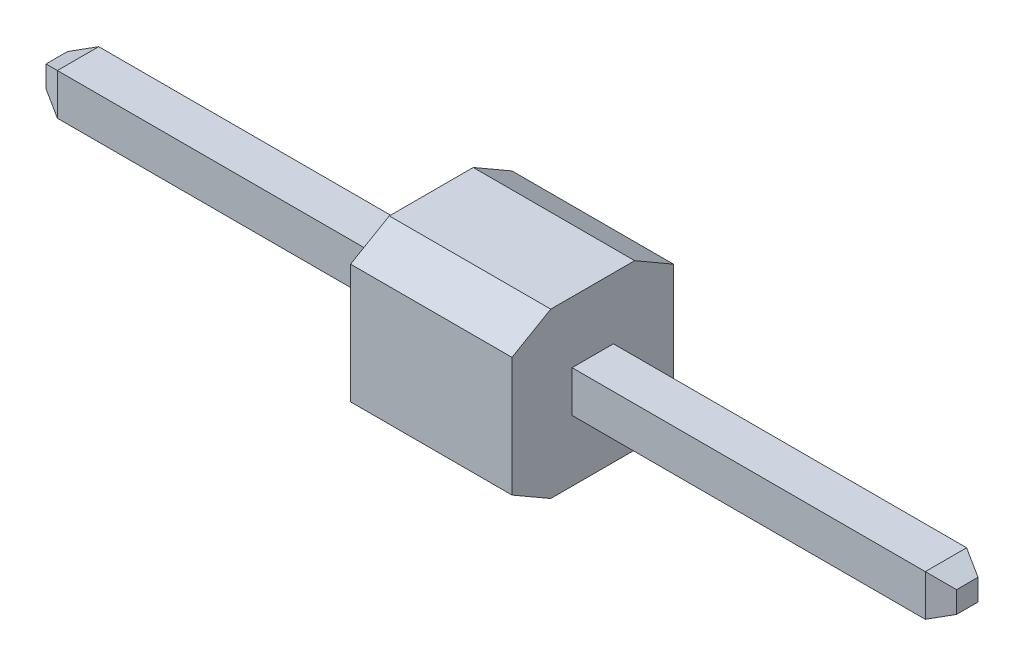
ISO-10303-21;
HEADER;
FILE_DESCRIPTION(('STEP AP214'),'2;1');
FILE_NAME('part.step','',(''),(''),'','','');
FILE_SCHEMA(('AUTOMOTIVE_DESIGN { 1 0 10303 214 1 1 1 1 }'));
ENDSEC;
DATA;
#1=APPLICATION_CONTEXT('core data for automotive mechanical design processes');
#2=APPLICATION_PROTOCOL_DEFINITION('international standard','automotive_design',2000,#1);
#3=PRODUCT_CONTEXT('',#1,'mechanical');
#4=PRODUCT('Part','Part','',(#3));
#5=PRODUCT_RELATED_PRODUCT_CATEGORY('part','',(#4));
#6=PRODUCT_DEFINITION_FORMATION('','',#4);
#7=PRODUCT_DEFINITION_CONTEXT('part definition',#1,'design');
#8=PRODUCT_DEFINITION('design','',#6,#7);
#9=PRODUCT_DEFINITION_SHAPE('','',#8);
#10=(LENGTH_UNIT() NAMED_UNIT(*) SI_UNIT(.MILLI.,.METRE.));
#11=(NAMED_UNIT(*) PLANE_ANGLE_UNIT() SI_UNIT($,.RADIAN.));
#12=(NAMED_UNIT(*) SI_UNIT($,.STERADIAN.) SOLID_ANGLE_UNIT());
#13=UNCERTAINTY_MEASURE_WITH_UNIT(LENGTH_MEASURE(1.E-05),#10,'distance_accuracy_value','');
#14=(GEOMETRIC_REPRESENTATION_CONTEXT(3) GLOBAL_UNCERTAINTY_ASSIGNED_CONTEXT((#13)) GLOBAL_UNIT_ASSIGNED_CONTEXT((#10,
#11,#12)) REPRESENTATION_CONTEXT('',''));
#15=CARTESIAN_POINT('',(0.,0.,0.));
#16=DIRECTION('',(0.,0.,1.));
#17=DIRECTION('',(1.,0.,0.));
#18=AXIS2_PLACEMENT_3D('',#15,#16,#17);
#19=CARTESIAN_POINT('',(5.4210498472222,-9.84287855189696,-2.62999736619335));
#20=DIRECTION('',(1.,-9.93476518829084E-08,4.37113882867379E-08));
#21=DIRECTION('',(-9.93476589883358E-08,-1.,8.74227765734759E-08));
#22=AXIS2_PLACEMENT_3D('',#19,#20,#21);
#23=PLANE('',#22);
#24=DIRECTION('',(-1.18186632778994E-08,-0.500000075710538,-0.866025360072935));
#25=VECTOR('',#24,1.);
#26=CARTESIAN_POINT('',(5.4210496550476,-11.0864682531292,-1.05999725747527));
#27=LINE('',#26,#25);
#28=CARTESIAN_POINT('',(5.4210496550476,-11.0864682531292,-1.05999725747527));
#29=VERTEX_POINT('',#28);
#30=CARTESIAN_POINT('',(5.42104964685939,-11.4328784670969,-1.65999722719114));
#31=VERTEX_POINT('',#30);
#32=EDGE_CURVE('E11',#29,#31,#27,.T.);
#33=ORIENTED_EDGE('',*,*,#32,.T.);
#34=DIRECTION('',(4.37113811813104E-08,-8.74227842254741E-08,-0.999999999999995));
#35=VECTOR('',#34,1.);
#36=CARTESIAN_POINT('',(5.42104964685939,-11.4328784670969,-1.65999722719114));
#37=LINE('',#36,#35);
#38=CARTESIAN_POINT('',(5.42104970368418,-11.4328785807465,-2.95999722719114));
#39=VERTEX_POINT('',#38);
#40=EDGE_CURVE('E304',#31,#39,#37,.T.);
#41=ORIENTED_EDGE('',*,*,#40,.T.);
#42=DIRECTION('',(8.75289963529268E-08,0.499999924289837,-0.866025447495713));
#43=VECTOR('',#42,1.);
#44=CARTESIAN_POINT('',(5.42104970368418,-11.4328785807465,-2.95999722719114));
#45=LINE('',#44,#43);
#46=CARTESIAN_POINT('',(5.42104976432605,-11.0864684716862,-3.55999725747527));
#47=VERTEX_POINT('',#46);
#48=EDGE_CURVE('E296',#39,#47,#45,.T.);
#49=ORIENTED_EDGE('',*,*,#48,.T.);
#50=DIRECTION('',(9.93476593243698E-08,0.999999999999991,-8.74227764821842E-08));
#51=VECTOR('',#50,1.);
#52=CARTESIAN_POINT('',(5.42104976432605,-11.0864684716862,-3.55999725747527));
#53=LINE('',#52,#51);
#54=CARTESIAN_POINT('',(5.42104994783903,-9.23928879471415,-3.55999741896085));
#55=VERTEX_POINT('',#54);
#56=EDGE_CURVE('E281',#47,#55,#53,.T.);
#57=ORIENTED_EDGE('',*,*,#56,.T.);
#58=DIRECTION('',(-1.18186619959243E-08,-0.500000075710538,-0.866025360072935));
#59=VECTOR('',#58,1.);
#60=CARTESIAN_POINT('',(5.42104995602724,-8.89287858074648,-2.95999744924499));
#61=LINE('',#60,#59);
#62=CARTESIAN_POINT('',(5.42104995602724,-8.89287858074648,-2.95999744924499));
#63=VERTEX_POINT('',#62);
#64=EDGE_CURVE('E265',#63,#55,#61,.T.);
#65=ORIENTED_EDGE('',*,*,#64,.F.);
#66=DIRECTION('',(4.37113811813104E-08,-8.74227842254741E-08,-0.999999999999995));
#67=VECTOR('',#66,1.);
#68=CARTESIAN_POINT('',(5.42104989920244,-8.89287846709686,-1.65999744924499));
#69=LINE('',#68,#67);
#70=CARTESIAN_POINT('',(5.42104989920244,-8.89287846709686,-1.65999744924499));
#71=VERTEX_POINT('',#70);
#72=EDGE_CURVE('E248',#71,#63,#69,.T.);
#73=ORIENTED_EDGE('',*,*,#72,.F.);
#74=DIRECTION('',(8.75289950709517E-08,0.499999924289837,-0.866025447495713));
#75=VECTOR('',#74,1.);
#76=CARTESIAN_POINT('',(5.42104983856057,-9.23928857615719,-1.05999741896085));
#77=LINE('',#76,#75);
#78=CARTESIAN_POINT('',(5.42104983856057,-9.23928857615719,-1.05999741896085));
#79=VERTEX_POINT('',#78);
#80=EDGE_CURVE('E242',#79,#71,#77,.T.);
#81=ORIENTED_EDGE('',*,*,#80,.F.);
#82=DIRECTION('',(9.93476593243698E-08,0.999999999999991,-8.74227764821842E-08));
#83=VECTOR('',#82,1.);
#84=CARTESIAN_POINT('',(5.4210496550476,-11.0864682531292,-1.05999725747527));
#85=LINE('',#84,#83);
#86=EDGE_CURVE('E236',#29,#79,#85,.T.);
#87=ORIENTED_EDGE('',*,*,#86,.F.);
#88=EDGE_LOOP('',(#33,#41,#49,#57,#65,#73,#81,#87));
#89=FACE_BOUND('',#88,.T.);
#90=DIRECTION('',(-4.37113817364219E-08,8.74227829017466E-08,0.999999999999995));
#91=VECTOR('',#90,1.);
#92=CARTESIAN_POINT('',(5.4210497836397,-10.482878551897,-2.62999731024277));
#93=LINE('',#92,#91);
#94=CARTESIAN_POINT('',(5.4210497836397,-10.482878551897,-2.62999731024277));
#95=VERTEX_POINT('',#94);
#96=CARTESIAN_POINT('',(5.42104975566442,-10.4828784959464,-1.98999731024277));
#97=VERTEX_POINT('',#96);
#98=EDGE_CURVE('E302',#95,#97,#93,.T.);
#99=ORIENTED_EDGE('',*,*,#98,.T.);
#100=DIRECTION('',(-9.93476592658906E-08,-0.999999999999991,8.74227766567418E-08));
#101=VECTOR('',#100,1.);
#102=CARTESIAN_POINT('',(5.42104981924692,-9.84287849594638,-1.98999736619335));
#103=LINE('',#102,#101);
#104=CARTESIAN_POINT('',(5.42104981924692,-9.84287849594638,-1.98999736619335));
#105=VERTEX_POINT('',#104);
#106=EDGE_CURVE('E293',#105,#97,#103,.T.);
#107=ORIENTED_EDGE('',*,*,#106,.F.);
#108=DIRECTION('',(-4.37113817364219E-08,8.74227856773042E-08,0.999999999999995));
#109=VECTOR('',#108,1.);
#110=CARTESIAN_POINT('',(5.4210498472222,-9.84287855189696,-2.62999736619335));
#111=LINE('',#110,#109);
#112=CARTESIAN_POINT('',(5.4210498472222,-9.84287855189696,-2.62999736619335));
#113=VERTEX_POINT('',#112);
#114=EDGE_CURVE('E278',#113,#105,#111,.T.);
#115=ORIENTED_EDGE('',*,*,#114,.F.);
#116=DIRECTION('',(-9.93476592658908E-08,-0.999999999999991,8.7422776656742E-08));
#117=VECTOR('',#116,1.);
#118=CARTESIAN_POINT('',(5.4210498472222,-9.84287855189696,-2.62999736619335));
#119=LINE('',#118,#117);
#120=EDGE_CURVE('E263',#113,#95,#119,.T.);
#121=ORIENTED_EDGE('',*,*,#120,.T.);
#122=EDGE_LOOP('',(#99,#107,#115,#121));
#123=FACE_BOUND('',#122,.T.);
#124=ADVANCED_FACE('F17',(#89,#123),#23,.T.);
#125=CARTESIAN_POINT('',(2.9210498472222,-9.84287830352783,-2.62999747547182));
#126=DIRECTION('',(1.,-9.93476518829084E-08,4.37113882867379E-08));
#127=DIRECTION('',(-9.93476589883358E-08,-1.,8.74227765734759E-08));
#128=AXIS2_PLACEMENT_3D('',#125,#126,#127);
#129=PLANE('',#128);
#130=DIRECTION('',(-1.18186632778994E-08,-0.500000075710538,-0.866025360072935));
#131=VECTOR('',#130,1.);
#132=CARTESIAN_POINT('',(2.9210496550476,-11.0864680047601,-1.05999736675374));
#133=LINE('',#132,#131);
#134=CARTESIAN_POINT('',(2.9210496550476,-11.0864680047601,-1.05999736675374));
#135=VERTEX_POINT('',#134);
#136=CARTESIAN_POINT('',(2.92104964685939,-11.4328782187277,-1.65999733646961));
#137=VERTEX_POINT('',#136);
#138=EDGE_CURVE('E24',#135,#137,#133,.T.);
#139=ORIENTED_EDGE('',*,*,#138,.F.);
#140=DIRECTION('',(9.9347659083955E-08,0.999999999999991,-8.74227764821842E-08));
#141=VECTOR('',#140,1.);
#142=CARTESIAN_POINT('',(2.9210496550476,-11.0864680047601,-1.05999736675374));
#143=LINE('',#142,#141);
#144=CARTESIAN_POINT('',(2.92104983856057,-9.23928832778806,-1.05999752823932));
#145=VERTEX_POINT('',#144);
#146=EDGE_CURVE('E300',#135,#145,#143,.T.);
#147=ORIENTED_EDGE('',*,*,#146,.T.);
#148=DIRECTION('',(8.75289957119392E-08,0.499999924289837,-0.866025447495713));
#149=VECTOR('',#148,1.);
#150=CARTESIAN_POINT('',(2.92104983856057,-9.23928832778806,-1.05999752823932));
#151=LINE('',#150,#149);
#152=CARTESIAN_POINT('',(2.92104989920244,-8.89287821872773,-1.65999755852346));
#153=VERTEX_POINT('',#152);
#154=EDGE_CURVE('E286',#145,#153,#151,.T.);
#155=ORIENTED_EDGE('',*,*,#154,.T.);
#156=DIRECTION('',(4.37113811813104E-08,-8.74227842254741E-08,-0.999999999999995));
#157=VECTOR('',#156,1.);
#158=CARTESIAN_POINT('',(2.92104989920244,-8.89287821872773,-1.65999755852346));
#159=LINE('',#158,#157);
#160=CARTESIAN_POINT('',(2.92104995602724,-8.89287833237735,-2.95999755852346));
#161=VERTEX_POINT('',#160);
#162=EDGE_CURVE('E271',#153,#161,#159,.T.);
#163=ORIENTED_EDGE('',*,*,#162,.T.);
#164=DIRECTION('',(-1.18186626369119E-08,-0.500000075710538,-0.866025360072935));
#165=VECTOR('',#164,1.);
#166=CARTESIAN_POINT('',(2.92104995602724,-8.89287833237735,-2.95999755852346));
#167=LINE('',#166,#165);
#168=CARTESIAN_POINT('',(2.92104994783903,-9.23928854634502,-3.55999752823932));
#169=VERTEX_POINT('',#168);
#170=EDGE_CURVE('E253',#161,#169,#167,.T.);
#171=ORIENTED_EDGE('',*,*,#170,.T.);
#172=DIRECTION('',(9.9347659083955E-08,0.999999999999991,-8.74227764821842E-08));
#173=VECTOR('',#172,1.);
#174=CARTESIAN_POINT('',(2.92104976432605,-11.086468223317,-3.55999736675375));
#175=LINE('',#174,#173);
#176=CARTESIAN_POINT('',(2.92104976432605,-11.086468223317,-3.55999736675375));
#177=VERTEX_POINT('',#176);
#178=EDGE_CURVE('E261',#177,#169,#175,.T.);
#179=ORIENTED_EDGE('',*,*,#178,.F.);
#180=DIRECTION('',(8.75289963529268E-08,0.499999924289837,-0.866025447495713));
#181=VECTOR('',#180,1.);
#182=CARTESIAN_POINT('',(2.92104970368418,-11.4328783323774,-2.95999733646961));
#183=LINE('',#182,#181);
#184=CARTESIAN_POINT('',(2.92104970368418,-11.4328783323774,-2.95999733646961));
#185=VERTEX_POINT('',#184);
#186=EDGE_CURVE('E276',#185,#177,#183,.T.);
#187=ORIENTED_EDGE('',*,*,#186,.F.);
#188=DIRECTION('',(4.37113811813104E-08,-8.74227842254741E-08,-0.999999999999995));
#189=VECTOR('',#188,1.);
#190=CARTESIAN_POINT('',(2.92104964685939,-11.4328782187277,-1.65999733646961));
#191=LINE('',#190,#189);
#192=EDGE_CURVE('E291',#137,#185,#191,.T.);
#193=ORIENTED_EDGE('',*,*,#192,.F.);
#194=EDGE_LOOP('',(#139,#147,#155,#163,#171,#179,#187,#193));
#195=FACE_BOUND('',#194,.T.);
#196=DIRECTION('',(-9.93476585720012E-08,-0.999999999999991,8.74227766567418E-08));
#197=VECTOR('',#196,1.);
#198=CARTESIAN_POINT('',(2.92104981924692,-9.84287824757725,-1.98999747547182));
#199=LINE('',#198,#197);
#200=CARTESIAN_POINT('',(2.92104981924692,-9.84287824757725,-1.98999747547182));
#201=VERTEX_POINT('',#200);
#202=CARTESIAN_POINT('',(2.92104975566442,-10.4828782475773,-1.98999741952124));
#203=VERTEX_POINT('',#202);
#204=EDGE_CURVE('E298',#201,#203,#199,.T.);
#205=ORIENTED_EDGE('',*,*,#204,.T.);
#206=DIRECTION('',(-4.37113810425325E-08,8.74227829017466E-08,0.999999999999995));
#207=VECTOR('',#206,1.);
#208=CARTESIAN_POINT('',(2.9210497836397,-10.4828783035278,-2.62999741952124));
#209=LINE('',#208,#207);
#210=CARTESIAN_POINT('',(2.9210497836397,-10.4828783035278,-2.62999741952124));
#211=VERTEX_POINT('',#210);
#212=EDGE_CURVE('E283',#211,#203,#209,.T.);
#213=ORIENTED_EDGE('',*,*,#212,.F.);
#214=DIRECTION('',(-9.93476592658908E-08,-0.999999999999991,8.7422776656742E-08));
#215=VECTOR('',#214,1.);
#216=CARTESIAN_POINT('',(2.9210498472222,-9.84287830352783,-2.62999747547182));
#217=LINE('',#216,#215);
#218=CARTESIAN_POINT('',(2.9210498472222,-9.84287830352783,-2.62999747547182));
#219=VERTEX_POINT('',#218);
#220=EDGE_CURVE('E268',#219,#211,#217,.T.);
#221=ORIENTED_EDGE('',*,*,#220,.F.);
#222=DIRECTION('',(-4.37113817364219E-08,8.74227856773042E-08,0.999999999999995));
#223=VECTOR('',#222,1.);
#224=CARTESIAN_POINT('',(2.9210498472222,-9.84287830352783,-2.62999747547182));
#225=LINE('',#224,#223);
#226=EDGE_CURVE('E251',#219,#201,#225,.T.);
#227=ORIENTED_EDGE('',*,*,#226,.T.);
#228=EDGE_LOOP('',(#205,#213,#221,#227));
#229=FACE_BOUND('',#228,.T.);
#230=ADVANCED_FACE('F314',(#195,#229),#129,.F.);
#231=CARTESIAN_POINT('',(5.4210496550476,-11.0864682531292,-1.05999725747527));
#232=DIRECTION('',(1.07893287081065E-07,0.866025360072937,-0.500000075710535));
#233=DIRECTION('',(1.18186629566715E-08,0.500000075710542,0.866025360072941));
#234=AXIS2_PLACEMENT_3D('',#231,#232,#233);
#235=PLANE('',#234);
#236=ORIENTED_EDGE('',*,*,#138,.T.);
#237=DIRECTION('',(-0.999999999999994,9.93476518829078E-08,-4.37113883755555E-08));
#238=VECTOR('',#237,1.);
#239=CARTESIAN_POINT('',(5.42104964685939,-11.4328784670969,-1.65999722719114));
#240=LINE('',#239,#238);
#241=EDGE_CURVE('E288',#31,#137,#240,.T.);
#242=ORIENTED_EDGE('',*,*,#241,.F.);
#243=ORIENTED_EDGE('',*,*,#32,.F.);
#244=DIRECTION('',(-0.999999999999994,9.93476518829078E-08,-4.3711388109102E-08));
#245=VECTOR('',#244,1.);
#246=CARTESIAN_POINT('',(5.4210496550476,-11.0864682531292,-1.05999725747527));
#247=LINE('',#246,#245);
#248=EDGE_CURVE('E256',#29,#135,#247,.T.);
#249=ORIENTED_EDGE('',*,*,#248,.T.);
#250=EDGE_LOOP('',(#236,#242,#243,#249));
#251=FACE_BOUND('',#250,.T.);
#252=ADVANCED_FACE('F306',(#251),#235,.F.);
#253=CARTESIAN_POINT('',(5.42104964685939,-11.4328784670969,-1.65999722719114));
#254=DIRECTION('',(9.93476589883358E-08,1.,-8.74227765734759E-08));
#255=DIRECTION('',(1.,-9.93476518829084E-08,4.37113882867379E-08));
#256=AXIS2_PLACEMENT_3D('',#253,#254,#255);
#257=PLANE('',#256);
#258=ORIENTED_EDGE('',*,*,#192,.T.);
#259=DIRECTION('',(-0.999999999999994,9.93476518829078E-08,-4.37113882867377E-08));
#260=VECTOR('',#259,1.);
#261=CARTESIAN_POINT('',(5.42104970368418,-11.4328785807465,-2.95999722719114));
#262=LINE('',#261,#260);
#263=EDGE_CURVE('E273',#39,#185,#262,.T.);
#264=ORIENTED_EDGE('',*,*,#263,.F.);
#265=ORIENTED_EDGE('',*,*,#40,.F.);
#266=ORIENTED_EDGE('',*,*,#241,.T.);
#267=EDGE_LOOP('',(#258,#264,#265,#266));
#268=FACE_BOUND('',#267,.T.);
#269=ADVANCED_FACE('F311',(#268),#257,.F.);
#270=CARTESIAN_POINT('',(5.42104970368418,-11.4328785807465,-2.95999722719114));
#271=DIRECTION('',(6.41819058997377E-08,0.866025447495721,0.499999924289845));
#272=DIRECTION('',(-8.7528996031702E-08,-0.499999924289838,0.866025447495717));
#273=AXIS2_PLACEMENT_3D('',#270,#271,#272);
#274=PLANE('',#273);
#275=ORIENTED_EDGE('',*,*,#186,.T.);
#276=DIRECTION('',(-0.999999999999994,9.93476518829078E-08,-4.37113882867377E-08));
#277=VECTOR('',#276,1.);
#278=CARTESIAN_POINT('',(5.42104976432605,-11.0864684716862,-3.55999725747527));
#279=LINE('',#278,#277);
#280=EDGE_CURVE('E258',#47,#177,#279,.T.);
#281=ORIENTED_EDGE('',*,*,#280,.F.);
#282=ORIENTED_EDGE('',*,*,#48,.F.);
#283=ORIENTED_EDGE('',*,*,#263,.T.);
#284=EDGE_LOOP('',(#275,#281,#282,#283));
#285=FACE_BOUND('',#284,.T.);
#286=ADVANCED_FACE('F319',(#285),#274,.F.);
#287=CARTESIAN_POINT('',(5.42104976432605,-11.0864684716862,-3.55999725747527));
#288=DIRECTION('',(-4.37113811813106E-08,8.74227836789032E-08,1.));
#289=DIRECTION('',(-1.,9.93476518829084E-08,-4.37113882867379E-08));
#290=AXIS2_PLACEMENT_3D('',#287,#288,#289);
#291=PLANE('',#290);
#292=ORIENTED_EDGE('',*,*,#178,.T.);
#293=DIRECTION('',(-0.999999999999994,9.93476525934505E-08,-4.37113882867377E-08));
#294=VECTOR('',#293,1.);
#295=CARTESIAN_POINT('',(5.42104994783903,-9.23928879471415,-3.55999741896085));
#296=LINE('',#295,#294);
#297=EDGE_CURVE('E245',#55,#169,#296,.T.);
#298=ORIENTED_EDGE('',*,*,#297,.F.);
#299=ORIENTED_EDGE('',*,*,#56,.F.);
#300=ORIENTED_EDGE('',*,*,#280,.T.);
#301=EDGE_LOOP('',(#292,#298,#299,#300));
#302=FACE_BOUND('',#301,.T.);
#303=ADVANCED_FACE('F326',(#302),#291,.F.);
#304=CARTESIAN_POINT('',(5.42104995602724,-8.89287858074648,-2.95999744924499));
#305=DIRECTION('',(1.07893287081065E-07,0.866025360072937,-0.500000075710535));
#306=DIRECTION('',(1.18186629566715E-08,0.500000075710542,0.866025360072941));
#307=AXIS2_PLACEMENT_3D('',#304,#305,#306);
#308=PLANE('',#307);
#309=ORIENTED_EDGE('',*,*,#170,.F.);
#310=DIRECTION('',(-0.999999999999994,9.93476518829078E-08,-4.37113882867377E-08));
#311=VECTOR('',#310,1.);
#312=CARTESIAN_POINT('',(5.42104995602724,-8.89287858074648,-2.95999744924499));
#313=LINE('',#312,#311);
#314=EDGE_CURVE('E239',#63,#161,#313,.T.);
#315=ORIENTED_EDGE('',*,*,#314,.F.);
#316=ORIENTED_EDGE('',*,*,#64,.T.);
#317=ORIENTED_EDGE('',*,*,#297,.T.);
#318=EDGE_LOOP('',(#309,#315,#316,#317));
#319=FACE_BOUND('',#318,.T.);
#320=ADVANCED_FACE('F329',(#319),#308,.T.);
#321=CARTESIAN_POINT('',(5.42104989920244,-8.89287846709686,-1.65999744924499));
#322=DIRECTION('',(9.93476589883358E-08,1.,-8.74227765734759E-08));
#323=DIRECTION('',(1.,-9.93476518829084E-08,4.37113882867379E-08));
#324=AXIS2_PLACEMENT_3D('',#321,#322,#323);
#325=PLANE('',#324);
#326=ORIENTED_EDGE('',*,*,#162,.F.);
#327=DIRECTION('',(-0.999999999999994,9.93476518829078E-08,-4.37113883755555E-08));
#328=VECTOR('',#327,1.);
#329=CARTESIAN_POINT('',(5.42104989920244,-8.89287846709686,-1.65999744924499));
#330=LINE('',#329,#328);
#331=EDGE_CURVE('E233',#71,#153,#330,.T.);
#332=ORIENTED_EDGE('',*,*,#331,.F.);
#333=ORIENTED_EDGE('',*,*,#72,.T.);
#334=ORIENTED_EDGE('',*,*,#314,.T.);
#335=EDGE_LOOP('',(#326,#332,#333,#334));
#336=FACE_BOUND('',#335,.T.);
#337=ADVANCED_FACE('F333',(#336),#325,.T.);
#338=CARTESIAN_POINT('',(5.42104983856057,-9.23928857615719,-1.05999741896085));
#339=DIRECTION('',(6.41819058997377E-08,0.866025447495721,0.499999924289845));
#340=DIRECTION('',(-8.7528996031702E-08,-0.499999924289838,0.866025447495717));
#341=AXIS2_PLACEMENT_3D('',#338,#339,#340);
#342=PLANE('',#341);
#343=ORIENTED_EDGE('',*,*,#154,.F.);
#344=DIRECTION('',(-0.999999999999994,9.93476525934505E-08,-4.3711388109102E-08));
#345=VECTOR('',#344,1.);
#346=CARTESIAN_POINT('',(5.42104983856057,-9.23928857615719,-1.05999741896085));
#347=LINE('',#346,#345);
#348=EDGE_CURVE('E230',#79,#145,#347,.T.);
#349=ORIENTED_EDGE('',*,*,#348,.F.);
#350=ORIENTED_EDGE('',*,*,#80,.T.);
#351=ORIENTED_EDGE('',*,*,#331,.T.);
#352=EDGE_LOOP('',(#343,#349,#350,#351));
#353=FACE_BOUND('',#352,.T.);
#354=ADVANCED_FACE('F337',(#353),#342,.T.);
#355=CARTESIAN_POINT('',(5.4210496550476,-11.0864682531292,-1.05999725747527));
#356=DIRECTION('',(-4.37113811813106E-08,8.74227835615132E-08,1.));
#357=DIRECTION('',(-9.93476589883358E-08,-1.,8.74227764560859E-08));
#358=AXIS2_PLACEMENT_3D('',#355,#356,#357);
#359=PLANE('',#358);
#360=ORIENTED_EDGE('',*,*,#146,.F.);
#361=ORIENTED_EDGE('',*,*,#248,.F.);
#362=ORIENTED_EDGE('',*,*,#86,.T.);
#363=ORIENTED_EDGE('',*,*,#348,.T.);
#364=EDGE_LOOP('',(#360,#361,#362,#363));
#365=FACE_BOUND('',#364,.T.);
#366=ADVANCED_FACE('F339',(#365),#359,.T.);
#367=CARTESIAN_POINT('',(-2.8789501527778,-9.84287772731145,-2.62999772899787));
#368=DIRECTION('',(-1.,9.93476518829084E-08,-4.37113882867379E-08));
#369=DIRECTION('',(9.93476589883358E-08,1.,-8.74227765734759E-08));
#370=AXIS2_PLACEMENT_3D('',#367,#368,#369);
#371=PLANE('',#370);
#372=DIRECTION('',(9.93476581453995E-08,0.999999999999991,-8.74227761394067E-08));
#373=VECTOR('',#372,1.);
#374=CARTESIAN_POINT('',(-2.87895022232144,-10.3289961576226,-2.14387921369105));
#375=LINE('',#374,#373);
#376=CARTESIAN_POINT('',(-2.87895022232144,-10.3289961576226,-2.14387921369105));
#377=VERTEX_POINT('',#376);
#378=CARTESIAN_POINT('',(-2.87895018931448,-9.99675921200462,-2.14387924273612));
#379=VERTEX_POINT('',#378);
#380=EDGE_CURVE('E228',#377,#379,#375,.T.);
#381=ORIENTED_EDGE('',*,*,#380,.T.);
#382=DIRECTION('',(4.37113820547149E-08,-8.74227801493995E-08,-0.999999999999995));
#383=VECTOR('',#382,1.);
#384=CARTESIAN_POINT('',(-2.87895018931448,-9.99675921200462,-2.14387924273612));
#385=LINE('',#384,#383);
#386=CARTESIAN_POINT('',(-2.87895017479194,-9.9967592410497,-2.47611618835412));
#387=VERTEX_POINT('',#386);
#388=EDGE_CURVE('E223',#379,#387,#385,.T.);
#389=ORIENTED_EDGE('',*,*,#388,.T.);
#390=DIRECTION('',(-9.93476608187272E-08,-0.999999999999991,8.74227761394063E-08));
#391=VECTOR('',#390,1.);
#392=CARTESIAN_POINT('',(-2.87895017479194,-9.9967592410497,-2.47611618835412));
#393=LINE('',#392,#391);
#394=CARTESIAN_POINT('',(-2.8789502077989,-10.3289961866677,-2.47611615930905));
#395=VERTEX_POINT('',#394);
#396=EDGE_CURVE('E215',#387,#395,#393,.T.);
#397=ORIENTED_EDGE('',*,*,#396,.T.);
#398=DIRECTION('',(-4.37113740347301E-08,8.74227801493995E-08,0.999999999999995));
#399=VECTOR('',#398,1.);
#400=CARTESIAN_POINT('',(-2.8789502077989,-10.3289961866677,-2.47611615930905));
#401=LINE('',#400,#399);
#402=EDGE_CURVE('E207',#395,#377,#401,.T.);
#403=ORIENTED_EDGE('',*,*,#402,.T.);
#404=EDGE_LOOP('',(#381,#389,#397,#403));
#405=FACE_BOUND('',#404,.T.);
#406=ADVANCED_FACE('F341',(#405),#371,.T.);
#407=CARTESIAN_POINT('',(-2.8789501527778,-9.84287772731145,-2.62999772899787));
#408=DIRECTION('',(9.93476589883358E-08,1.,-8.74227764510112E-08));
#409=DIRECTION('',(-4.37113811813106E-08,8.74227835564385E-08,1.));
#410=AXIS2_PLACEMENT_3D('',#407,#408,#409);
#411=PLANE('',#410);
#412=DIRECTION('',(0.999999999999994,-9.93476521037346E-08,4.37113882769953E-08));
#413=VECTOR('',#412,1.);
#414=CARTESIAN_POINT('',(-2.5489501527778,-9.84287776009618,-2.62999771457312));
#415=LINE('',#414,#413);
#416=CARTESIAN_POINT('',(-2.5489501527778,-9.84287776009618,-2.62999771457312));
#417=VERTEX_POINT('',#416);
#418=EDGE_CURVE('E225',#417,#219,#415,.T.);
#419=ORIENTED_EDGE('',*,*,#418,.F.);
#420=DIRECTION('',(-4.37113817364219E-08,8.74227829017466E-08,0.999999999999995));
#421=VECTOR('',#420,1.);
#422=CARTESIAN_POINT('',(-2.5489501527778,-9.84287776009618,-2.62999771457312));
#423=LINE('',#422,#421);
#424=CARTESIAN_POINT('',(-2.54895018075308,-9.8428777041456,-1.98999771457312));
#425=VERTEX_POINT('',#424);
#426=EDGE_CURVE('E217',#417,#425,#423,.T.);
#427=ORIENTED_EDGE('',*,*,#426,.T.);
#428=DIRECTION('',(0.999999999999994,-9.93476521037346E-08,4.3711388195809E-08));
#429=VECTOR('',#428,1.);
#430=CARTESIAN_POINT('',(-2.54895018075308,-9.8428777041456,-1.98999771457312));
#431=LINE('',#430,#429);
#432=EDGE_CURVE('E220',#425,#201,#431,.T.);
#433=ORIENTED_EDGE('',*,*,#432,.T.);
#434=ORIENTED_EDGE('',*,*,#226,.F.);
#435=EDGE_LOOP('',(#419,#427,#433,#434));
#436=FACE_BOUND('',#435,.T.);
#437=ADVANCED_FACE('F348',(#436),#411,.T.);
#438=CARTESIAN_POINT('',(-2.87895018075308,-9.84287767136087,-1.98999772899787));
#439=DIRECTION('',(-4.37113811813106E-08,8.74227836789032E-08,1.));
#440=DIRECTION('',(-1.,9.93476518829084E-08,-4.37113882867379E-08));
#441=AXIS2_PLACEMENT_3D('',#438,#439,#440);
#442=PLANE('',#441);
#443=ORIENTED_EDGE('',*,*,#432,.F.);
#444=DIRECTION('',(-9.93476592658906E-08,-0.999999999999991,8.74227766567418E-08));
#445=VECTOR('',#444,1.);
#446=CARTESIAN_POINT('',(-2.54895018075308,-9.8428777041456,-1.98999771457312));
#447=LINE('',#446,#445);
#448=CARTESIAN_POINT('',(-2.54895024433558,-10.4828777041456,-1.98999765862254));
#449=VERTEX_POINT('',#448);
#450=EDGE_CURVE('E209',#425,#449,#447,.T.);
#451=ORIENTED_EDGE('',*,*,#450,.T.);
#452=DIRECTION('',(0.999999999999994,-9.93476517789893E-08,4.3711388195809E-08));
#453=VECTOR('',#452,1.);
#454=CARTESIAN_POINT('',(-2.54895024433558,-10.4828777041456,-1.98999765862254));
#455=LINE('',#454,#453);
#456=EDGE_CURVE('E212',#449,#203,#455,.T.);
#457=ORIENTED_EDGE('',*,*,#456,.T.);
#458=ORIENTED_EDGE('',*,*,#204,.F.);
#459=EDGE_LOOP('',(#443,#451,#457,#458));
#460=FACE_BOUND('',#459,.T.);
#461=ADVANCED_FACE('F424',(#460),#442,.T.);
#462=CARTESIAN_POINT('',(-2.8789502163603,-10.4828777273115,-2.6299976730473));
#463=DIRECTION('',(9.93476589883357E-08,1.,-8.74227764040693E-08));
#464=DIRECTION('',(-4.37113811813106E-08,8.74227835094966E-08,1.));
#465=AXIS2_PLACEMENT_3D('',#462,#463,#464);
#466=PLANE('',#465);
#467=ORIENTED_EDGE('',*,*,#456,.F.);
#468=DIRECTION('',(4.37113831242006E-08,-8.74227829017466E-08,-0.999999999999995));
#469=VECTOR('',#468,1.);
#470=CARTESIAN_POINT('',(-2.54895024433558,-10.4828777041456,-1.98999765862254));
#471=LINE('',#470,#469);
#472=CARTESIAN_POINT('',(-2.5489502163603,-10.4828777600962,-2.62999765862254));
#473=VERTEX_POINT('',#472);
#474=EDGE_CURVE('E201',#449,#473,#471,.T.);
#475=ORIENTED_EDGE('',*,*,#474,.T.);
#476=DIRECTION('',(0.999999999999994,-9.93476517789893E-08,4.37113882769953E-08));
#477=VECTOR('',#476,1.);
#478=CARTESIAN_POINT('',(-2.5489502163603,-10.4828777600962,-2.62999765862254));
#479=LINE('',#478,#477);
#480=EDGE_CURVE('E204',#473,#211,#479,.T.);
#481=ORIENTED_EDGE('',*,*,#480,.T.);
#482=ORIENTED_EDGE('',*,*,#212,.T.);
#483=EDGE_LOOP('',(#467,#475,#481,#482));
#484=FACE_BOUND('',#483,.T.);
#485=ADVANCED_FACE('F421',(#484),#466,.F.);
#486=CARTESIAN_POINT('',(-2.8789501527778,-9.84287772731145,-2.62999772899787));
#487=DIRECTION('',(-4.37113811813106E-08,8.74227836789032E-08,1.));
#488=DIRECTION('',(-1.,9.93476518829084E-08,-4.37113882867379E-08));
#489=AXIS2_PLACEMENT_3D('',#486,#487,#488);
#490=PLANE('',#489);
#491=ORIENTED_EDGE('',*,*,#480,.F.);
#492=DIRECTION('',(9.93476606536693E-08,0.999999999999991,-8.74227766567418E-08));
#493=VECTOR('',#492,1.);
#494=CARTESIAN_POINT('',(-2.5489502163603,-10.4828777600962,-2.62999765862254));
#495=LINE('',#494,#493);
#496=EDGE_CURVE('E196',#473,#417,#495,.T.);
#497=ORIENTED_EDGE('',*,*,#496,.T.);
#498=ORIENTED_EDGE('',*,*,#418,.T.);
#499=ORIENTED_EDGE('',*,*,#220,.T.);
#500=EDGE_LOOP('',(#491,#497,#498,#499));
#501=FACE_BOUND('',#500,.T.);
#502=ADVANCED_FACE('F376',(#501),#490,.F.);
#503=CARTESIAN_POINT('',(-2.8789501527778,-9.84287772731145,-2.62999772899787));
#504=DIRECTION('',(-4.37113811813106E-08,8.74227836789032E-08,1.));
#505=DIRECTION('',(-1.,9.93476518829084E-08,-4.37113882867379E-08));
#506=AXIS2_PLACEMENT_3D('',#503,#504,#505);
#507=PLANE('',#506);
#508=DIRECTION('',(0.999999999999994,-9.93476517789893E-08,4.37113882769953E-08));
#509=VECTOR('',#508,1.);
#510=CARTESIAN_POINT('',(5.4210498472222,-9.84287855189696,-2.62999736619335));
#511=LINE('',#510,#509);
#512=CARTESIAN_POINT('',(10.8910498472222,-9.84287909532862,-2.62999712709206));
#513=VERTEX_POINT('',#512);
#514=EDGE_CURVE('E199',#113,#513,#511,.T.);
#515=ORIENTED_EDGE('',*,*,#514,.T.);
#516=DIRECTION('',(-9.93476606536693E-08,-0.999999999999991,8.74227766567418E-08));
#517=VECTOR('',#516,1.);
#518=CARTESIAN_POINT('',(10.8910498472222,-9.84287909532862,-2.62999712709206));
#519=LINE('',#518,#517);
#520=CARTESIAN_POINT('',(10.8910497836397,-10.4828790953286,-2.62999707114148));
#521=VERTEX_POINT('',#520);
#522=EDGE_CURVE('E191',#513,#521,#519,.T.);
#523=ORIENTED_EDGE('',*,*,#522,.T.);
#524=DIRECTION('',(0.999999999999994,-9.93476521037346E-08,4.37113882769953E-08));
#525=VECTOR('',#524,1.);
#526=CARTESIAN_POINT('',(5.4210497836397,-10.482878551897,-2.62999731024277));
#527=LINE('',#526,#525);
#528=EDGE_CURVE('E194',#95,#521,#527,.T.);
#529=ORIENTED_EDGE('',*,*,#528,.F.);
#530=ORIENTED_EDGE('',*,*,#120,.F.);
#531=EDGE_LOOP('',(#515,#523,#529,#530));
#532=FACE_BOUND('',#531,.T.);
#533=ADVANCED_FACE('F367',(#532),#507,.F.);
#534=CARTESIAN_POINT('',(-2.8789502163603,-10.4828777273115,-2.6299976730473));
#535=DIRECTION('',(9.93476589883357E-08,1.,-8.74227764040693E-08));
#536=DIRECTION('',(-4.37113811813106E-08,8.74227835094966E-08,1.));
#537=AXIS2_PLACEMENT_3D('',#534,#535,#536);
#538=PLANE('',#537);
#539=ORIENTED_EDGE('',*,*,#528,.T.);
#540=DIRECTION('',(-4.37113817364219E-08,8.74227829017466E-08,0.999999999999995));
#541=VECTOR('',#540,1.);
#542=CARTESIAN_POINT('',(10.8910497836397,-10.4828790953286,-2.62999707114148));
#543=LINE('',#542,#541);
#544=CARTESIAN_POINT('',(10.8910497556644,-10.482879039378,-1.98999707114148));
#545=VERTEX_POINT('',#544);
#546=EDGE_CURVE('E186',#521,#545,#543,.T.);
#547=ORIENTED_EDGE('',*,*,#546,.T.);
#548=DIRECTION('',(0.999999999999994,-9.93476521037346E-08,4.37113881146227E-08));
#549=VECTOR('',#548,1.);
#550=CARTESIAN_POINT('',(5.42104975566442,-10.4828784959464,-1.98999731024277));
#551=LINE('',#550,#549);
#552=EDGE_CURVE('E189',#97,#545,#551,.T.);
#553=ORIENTED_EDGE('',*,*,#552,.F.);
#554=ORIENTED_EDGE('',*,*,#98,.F.);
#555=EDGE_LOOP('',(#539,#547,#553,#554));
#556=FACE_BOUND('',#555,.T.);
#557=ADVANCED_FACE('F364',(#556),#538,.F.);
#558=CARTESIAN_POINT('',(-2.87895018075308,-9.84287767136087,-1.98999772899787));
#559=DIRECTION('',(-4.37113811813106E-08,8.74227836789032E-08,1.));
#560=DIRECTION('',(-1.,9.93476518829084E-08,-4.37113882867379E-08));
#561=AXIS2_PLACEMENT_3D('',#558,#559,#560);
#562=PLANE('',#561);
#563=ORIENTED_EDGE('',*,*,#552,.T.);
#564=DIRECTION('',(9.93476578781121E-08,0.999999999999991,-8.7422776656742E-08));
#565=VECTOR('',#564,1.);
#566=CARTESIAN_POINT('',(10.8910497556644,-10.482879039378,-1.98999707114148));
#567=LINE('',#566,#565);
#568=CARTESIAN_POINT('',(10.8910498192469,-9.84287903937804,-1.98999712709206));
#569=VERTEX_POINT('',#568);
#570=EDGE_CURVE('E176',#545,#569,#567,.T.);
#571=ORIENTED_EDGE('',*,*,#570,.T.);
#572=DIRECTION('',(0.999999999999994,-9.93476517789893E-08,4.37113881146227E-08));
#573=VECTOR('',#572,1.);
#574=CARTESIAN_POINT('',(5.42104981924692,-9.84287849594638,-1.98999736619335));
#575=LINE('',#574,#573);
#576=EDGE_CURVE('E179',#105,#569,#575,.T.);
#577=ORIENTED_EDGE('',*,*,#576,.F.);
#578=ORIENTED_EDGE('',*,*,#106,.T.);
#579=EDGE_LOOP('',(#563,#571,#577,#578));
#580=FACE_BOUND('',#579,.T.);
#581=ADVANCED_FACE('F366',(#580),#562,.T.);
#582=CARTESIAN_POINT('',(-2.8789501527778,-9.84287772731145,-2.62999772899787));
#583=DIRECTION('',(9.93476589883358E-08,1.,-8.74227764510112E-08));
#584=DIRECTION('',(-4.37113811813106E-08,8.74227835564385E-08,1.));
#585=AXIS2_PLACEMENT_3D('',#582,#583,#584);
#586=PLANE('',#585);
#587=ORIENTED_EDGE('',*,*,#576,.T.);
#588=DIRECTION('',(4.37113817364219E-08,-8.74227829017466E-08,-0.999999999999995));
#589=VECTOR('',#588,1.);
#590=CARTESIAN_POINT('',(10.8910498192469,-9.84287903937804,-1.98999712709206));
#591=LINE('',#590,#589);
#592=EDGE_CURVE('E167',#569,#513,#591,.T.);
#593=ORIENTED_EDGE('',*,*,#592,.T.);
#594=ORIENTED_EDGE('',*,*,#514,.F.);
#595=ORIENTED_EDGE('',*,*,#114,.T.);
#596=EDGE_LOOP('',(#587,#593,#594,#595));
#597=FACE_BOUND('',#596,.T.);
#598=ADVANCED_FACE('F373',(#597),#586,.T.);
#599=CARTESIAN_POINT('',(11.2210498472222,-9.84287912811334,-2.6299971126673));
#600=DIRECTION('',(-1.,9.93476518829084E-08,-4.37113882867379E-08));
#601=DIRECTION('',(9.93476589883358E-08,1.,-8.74227765734759E-08));
#602=AXIS2_PLACEMENT_3D('',#599,#600,#601);
#603=PLANE('',#602);
#604=DIRECTION('',(-9.93476581453989E-08,-0.999999999999991,8.74227761394063E-08));
#605=VECTOR('',#604,1.);
#606=CARTESIAN_POINT('',(11.2210498106855,-9.99676061280651,-2.14387862640555));
#607=LINE('',#606,#605);
#608=CARTESIAN_POINT('',(11.2210498106855,-9.99676061280651,-2.14387862640555));
#609=VERTEX_POINT('',#608);
#610=CARTESIAN_POINT('',(11.2210497776786,-10.3289975584245,-2.14387859736047));
#611=VERTEX_POINT('',#610);
#612=EDGE_CURVE('E153',#609,#611,#607,.T.);
#613=ORIENTED_EDGE('',*,*,#612,.T.);
#614=DIRECTION('',(4.37113820547149E-08,-8.74227801493994E-08,-0.999999999999995));
#615=VECTOR('',#614,1.);
#616=CARTESIAN_POINT('',(11.2210497776786,-10.3289975584245,-2.14387859736047));
#617=LINE('',#616,#615);
#618=CARTESIAN_POINT('',(11.2210497922011,-10.3289975874696,-2.47611554297847));
#619=VERTEX_POINT('',#618);
#620=EDGE_CURVE('E395',#611,#619,#617,.T.);
#621=ORIENTED_EDGE('',*,*,#620,.T.);
#622=DIRECTION('',(9.93476581453995E-08,0.999999999999991,-8.74227761394067E-08));
#623=VECTOR('',#622,1.);
#624=CARTESIAN_POINT('',(11.2210497922011,-10.3289975874696,-2.47611554297847));
#625=LINE('',#624,#623);
#626=CARTESIAN_POINT('',(11.2210498252081,-9.99676064185159,-2.47611557202355));
#627=VERTEX_POINT('',#626);
#628=EDGE_CURVE('E156',#619,#627,#625,.T.);
#629=ORIENTED_EDGE('',*,*,#628,.T.);
#630=DIRECTION('',(-4.37113874013715E-08,8.74227801493995E-08,0.999999999999995));
#631=VECTOR('',#630,1.);
#632=CARTESIAN_POINT('',(11.2210498252081,-9.99676064185159,-2.47611557202355));
#633=LINE('',#632,#631);
#634=EDGE_CURVE('E149',#627,#609,#633,.T.);
#635=ORIENTED_EDGE('',*,*,#634,.T.);
#636=EDGE_LOOP('',(#613,#621,#629,#635));
#637=FACE_BOUND('',#636,.T.);
#638=ADVANCED_FACE('F151',(#637),#603,.F.);
#639=CARTESIAN_POINT('',(-2.87895020107253,-10.3289962001205,-2.62999768650005));
#640=DIRECTION('',(-0.422618351780369,-0.906307745050466,6.07587120833484E-08));
#641=DIRECTION('',(4.37113811813106E-08,-8.74227835094966E-08,-1.));
#642=AXIS2_PLACEMENT_3D('',#639,#640,#641);
#643=PLANE('',#642);
#644=DIRECTION('',(0.834817073788749,-0.389281669540039,0.389281691158099));
#645=VECTOR('',#644,1.);
#646=CARTESIAN_POINT('',(-2.87895022232113,-10.3289961576223,-2.14387921369138));
#647=LINE('',#646,#645);
#648=EDGE_CURVE('E181',#377,#449,#647,.T.);
#649=ORIENTED_EDGE('',*,*,#648,.F.);
#650=ORIENTED_EDGE('',*,*,#402,.F.);
#651=DIRECTION('',(-0.834817107820822,0.389281737604206,0.389281550111906));
#652=VECTOR('',#651,1.);
#653=CARTESIAN_POINT('',(-2.54895021636008,-10.4828777600959,-2.6299976586223));
#654=LINE('',#653,#652);
#655=EDGE_CURVE('E404',#473,#395,#654,.T.);
#656=ORIENTED_EDGE('',*,*,#655,.F.);
#657=ORIENTED_EDGE('',*,*,#474,.F.);
#658=EDGE_LOOP('',(#649,#650,#656,#657));
#659=FACE_BOUND('',#658,.T.);
#660=ADVANCED_FACE('F418',(#659),#643,.T.);
#661=CARTESIAN_POINT('',(-2.87895015950417,-9.8428777138587,-2.47611620180687));
#662=DIRECTION('',(-0.422618222124847,-3.72458176658199E-08,-0.906307805509828));
#663=DIRECTION('',(9.93476589883358E-08,1.,-8.74227765734759E-08));
#664=AXIS2_PLACEMENT_3D('',#661,#662,#663);
#665=PLANE('',#664);
#666=ORIENTED_EDGE('',*,*,#655,.T.);
#667=ORIENTED_EDGE('',*,*,#396,.F.);
#668=DIRECTION('',(-0.834817185169257,-0.389281503665794,0.389281618176065));
#669=VECTOR('',#668,1.);
#670=CARTESIAN_POINT('',(-2.54895015277762,-9.84287776009636,-2.62999771457293));
#671=LINE('',#670,#669);
#672=EDGE_CURVE('E160',#417,#387,#671,.T.);
#673=ORIENTED_EDGE('',*,*,#672,.F.);
#674=ORIENTED_EDGE('',*,*,#496,.F.);
#675=EDGE_LOOP('',(#666,#667,#673,#674));
#676=FACE_BOUND('',#675,.T.);
#677=ADVANCED_FACE('F434',(#676),#665,.T.);
#678=CARTESIAN_POINT('',(-2.54895018075308,-9.8428777041456,-1.98999771457312));
#679=DIRECTION('',(0.422618301356777,-1.21218081559392E-07,-0.906307768563367));
#680=DIRECTION('',(-9.93476589883358E-08,-1.,8.74227765734759E-08));
#681=AXIS2_PLACEMENT_3D('',#678,#679,#680);
#682=PLANE('',#681);
#683=ORIENTED_EDGE('',*,*,#648,.T.);
#684=ORIENTED_EDGE('',*,*,#450,.F.);
#685=DIRECTION('',(0.834817151137182,0.389281571729962,0.389281623093936));
#686=VECTOR('',#685,1.);
#687=CARTESIAN_POINT('',(-2.87895018931439,-9.99675921200472,-2.14387924273622));
#688=LINE('',#687,#686);
#689=EDGE_CURVE('E170',#379,#425,#688,.T.);
#690=ORIENTED_EDGE('',*,*,#689,.F.);
#691=ORIENTED_EDGE('',*,*,#380,.F.);
#692=EDGE_LOOP('',(#683,#684,#690,#691));
#693=FACE_BOUND('',#692,.T.);
#694=ADVANCED_FACE('F413',(#693),#682,.F.);
#695=CARTESIAN_POINT('',(-2.5489501527778,-9.84287776009618,-2.62999771457312));
#696=DIRECTION('',(0.422618171701255,-0.906307829022729,9.770517399793E-08));
#697=DIRECTION('',(-4.37113811813106E-08,8.74227835564385E-08,1.));
#698=AXIS2_PLACEMENT_3D('',#695,#696,#697);
#699=PLANE('',#698);
#700=ORIENTED_EDGE('',*,*,#672,.T.);
#701=ORIENTED_EDGE('',*,*,#388,.F.);
#702=ORIENTED_EDGE('',*,*,#689,.T.);
#703=ORIENTED_EDGE('',*,*,#426,.F.);
#704=EDGE_LOOP('',(#700,#701,#702,#703));
#705=FACE_BOUND('',#704,.T.);
#706=ADVANCED_FACE('F429',(#705),#699,.F.);
#707=CARTESIAN_POINT('',(11.2210498319344,-9.99676065530434,-2.62999709921455));
#708=DIRECTION('',(0.422618351780369,0.906307745050466,-6.07587121258922E-08));
#709=DIRECTION('',(4.37113811813106E-08,-8.74227835564385E-08,-1.));
#710=AXIS2_PLACEMENT_3D('',#707,#708,#709);
#711=PLANE('',#710);
#712=DIRECTION('',(-0.834817107820823,0.389281737604205,0.389281550111905));
#713=VECTOR('',#712,1.);
#714=CARTESIAN_POINT('',(11.2210498106852,-9.99676061280684,-2.14387862640588));
#715=LINE('',#714,#713);
#716=EDGE_CURVE('E164',#609,#569,#715,.T.);
#717=ORIENTED_EDGE('',*,*,#716,.F.);
#718=ORIENTED_EDGE('',*,*,#634,.F.);
#719=DIRECTION('',(0.83481707378875,-0.389281669540038,0.389281691158098));
#720=VECTOR('',#719,1.);
#721=CARTESIAN_POINT('',(10.8910498472222,-9.84287909532862,-2.62999712709206));
#722=LINE('',#721,#720);
#723=EDGE_CURVE('E392',#513,#627,#722,.T.);
#724=ORIENTED_EDGE('',*,*,#723,.F.);
#725=ORIENTED_EDGE('',*,*,#592,.F.);
#726=EDGE_LOOP('',(#717,#718,#724,#725));
#727=FACE_BOUND('',#726,.T.);
#728=ADVANCED_FACE('F165',(#727),#711,.T.);
#729=CARTESIAN_POINT('',(10.8910498472222,-9.84287909532862,-2.62999712709206));
#730=DIRECTION('',(-0.422618301356777,1.21218081559392E-07,0.906307768563367));
#731=DIRECTION('',(-9.93476589883358E-08,-1.,8.74227765734759E-08));
#732=AXIS2_PLACEMENT_3D('',#729,#730,#731);
#733=PLANE('',#732);
#734=ORIENTED_EDGE('',*,*,#723,.T.);
#735=ORIENTED_EDGE('',*,*,#628,.F.);
#736=DIRECTION('',(0.834817151137182,0.389281571729962,0.389281623093936));
#737=VECTOR('',#736,1.);
#738=CARTESIAN_POINT('',(10.8910497836396,-10.4828790953286,-2.62999707114133));
#739=LINE('',#738,#737);
#740=EDGE_CURVE('E389',#521,#619,#739,.T.);
#741=ORIENTED_EDGE('',*,*,#740,.F.);
#742=ORIENTED_EDGE('',*,*,#522,.F.);
#743=EDGE_LOOP('',(#734,#735,#741,#742));
#744=FACE_BOUND('',#743,.T.);
#745=ADVANCED_FACE('F390',(#744),#733,.F.);
#746=CARTESIAN_POINT('',(11.2210498259733,-9.84287908561551,-2.1438786398583));
#747=DIRECTION('',(0.422618222124847,3.72458176658199E-08,0.906307805509828));
#748=DIRECTION('',(9.93476589883358E-08,1.,-8.74227765734759E-08));
#749=AXIS2_PLACEMENT_3D('',#746,#747,#748);
#750=PLANE('',#749);
#751=ORIENTED_EDGE('',*,*,#716,.T.);
#752=ORIENTED_EDGE('',*,*,#570,.F.);
#753=DIRECTION('',(-0.834817185169256,-0.389281503665798,0.389281618176065));
#754=VECTOR('',#753,1.);
#755=CARTESIAN_POINT('',(11.2210497776783,-10.3289975584242,-2.1438785973608));
#756=LINE('',#755,#754);
#757=EDGE_CURVE('E175',#611,#545,#756,.T.);
#758=ORIENTED_EDGE('',*,*,#757,.F.);
#759=ORIENTED_EDGE('',*,*,#612,.F.);
#760=EDGE_LOOP('',(#751,#752,#758,#759));
#761=FACE_BOUND('',#760,.T.);
#762=ADVANCED_FACE('F173',(#761),#750,.T.);
#763=CARTESIAN_POINT('',(10.8910497836397,-10.4828790953286,-2.62999707114148));
#764=DIRECTION('',(-0.422618171701255,0.906307829022729,-9.77051739553862E-08));
#765=DIRECTION('',(-4.37113811813106E-08,8.74227835094966E-08,1.));
#766=AXIS2_PLACEMENT_3D('',#763,#764,#765);
#767=PLANE('',#766);
#768=ORIENTED_EDGE('',*,*,#740,.T.);
#769=ORIENTED_EDGE('',*,*,#620,.F.);
#770=ORIENTED_EDGE('',*,*,#757,.T.);
#771=ORIENTED_EDGE('',*,*,#546,.F.);
#772=EDGE_LOOP('',(#768,#769,#770,#771));
#773=FACE_BOUND('',#772,.T.);
#774=ADVANCED_FACE('F394',(#773),#767,.F.);
#775=CLOSED_SHELL('',(#124,#230,#252,#269,#286,#303,#320,#337,#354,#366,#406,#437,#461,#485,
#502,#533,#557,#581,#598,#638,#660,#677,#694,#706,#728,#745,#762,#774));
#776=MANIFOLD_SOLID_BREP('B1',#775);
#777=ADVANCED_BREP_SHAPE_REPRESENTATION('',(#18,#776),#14);
#778=SHAPE_DEFINITION_REPRESENTATION(#9,#777);
ENDSEC;
END-ISO-10303-21;
